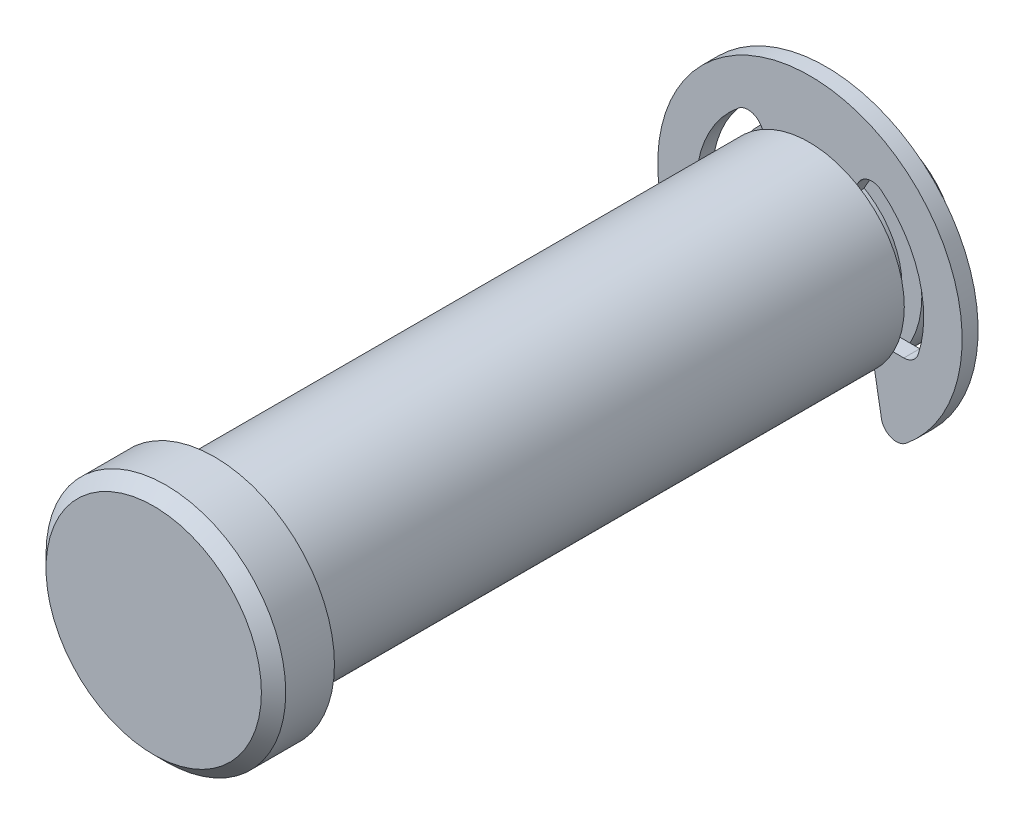
ISO-10303-21;
HEADER;
FILE_DESCRIPTION(('STEP AP214'),'2;1');
FILE_NAME('part.step','',(''),(''),'','','');
FILE_SCHEMA(('AUTOMOTIVE_DESIGN { 1 0 10303 214 1 1 1 1 }'));
ENDSEC;
DATA;
#1=APPLICATION_CONTEXT('core data for automotive mechanical design processes');
#2=APPLICATION_PROTOCOL_DEFINITION('international standard','automotive_design',2000,#1);
#3=PRODUCT_CONTEXT('',#1,'mechanical');
#4=PRODUCT('Part','Part','',(#3));
#5=PRODUCT_RELATED_PRODUCT_CATEGORY('part','',(#4));
#6=PRODUCT_DEFINITION_FORMATION('','',#4);
#7=PRODUCT_DEFINITION_CONTEXT('part definition',#1,'design');
#8=PRODUCT_DEFINITION('design','',#6,#7);
#9=PRODUCT_DEFINITION_SHAPE('','',#8);
#10=(LENGTH_UNIT() NAMED_UNIT(*) SI_UNIT(.MILLI.,.METRE.));
#11=(NAMED_UNIT(*) PLANE_ANGLE_UNIT() SI_UNIT($,.RADIAN.));
#12=(NAMED_UNIT(*) SI_UNIT($,.STERADIAN.) SOLID_ANGLE_UNIT());
#13=UNCERTAINTY_MEASURE_WITH_UNIT(LENGTH_MEASURE(1.E-05),#10,'distance_accuracy_value','');
#14=(GEOMETRIC_REPRESENTATION_CONTEXT(3) GLOBAL_UNCERTAINTY_ASSIGNED_CONTEXT((#13)) GLOBAL_UNIT_ASSIGNED_CONTEXT((#10,
#11,#12)) REPRESENTATION_CONTEXT('',''));
#15=CARTESIAN_POINT('',(0.,0.,0.));
#16=DIRECTION('',(0.,0.,1.));
#17=DIRECTION('',(1.,0.,0.));
#18=AXIS2_PLACEMENT_3D('',#15,#16,#17);
#19=CARTESIAN_POINT('',(0.,0.,-17.5133));
#20=DIRECTION('',(0.,0.,1.));
#21=DIRECTION('',(1.,0.,0.));
#22=AXIS2_PLACEMENT_3D('',#19,#20,#21);
#23=PLANE('',#22);
#24=DIRECTION('',(-0.173648177666931,0.984807753012208,0.));
#25=VECTOR('',#24,1.);
#26=CARTESIAN_POINT('',(3.38601453993856,0.59704572046233,-17.5133));
#27=LINE('',#26,#25);
#28=CARTESIAN_POINT('',(4.77272760963657,-7.26739490074226,-17.5133));
#29=VERTEX_POINT('',#28);
#30=CARTESIAN_POINT('',(4.02336,-3.01752,-17.5133));
#31=VERTEX_POINT('',#30);
#32=EDGE_CURVE('E205',#29,#31,#27,.T.);
#33=ORIENTED_EDGE('',*,*,#32,.F.);
#34=CARTESIAN_POINT('',(5.77329228669698,-7.09096835223266,-17.5133));
#35=DIRECTION('',(0.,0.,1.));
#36=DIRECTION('',(1.,0.,0.));
#37=AXIS2_PLACEMENT_3D('',#34,#35,#36);
#38=CIRCLE('',#37,1.016);
#39=CARTESIAN_POINT('',(6.41476920744109,-7.87885372470296,-17.5133));
#40=VERTEX_POINT('',#39);
#41=EDGE_CURVE('E259',#29,#40,#38,.T.);
#42=ORIENTED_EDGE('',*,*,#41,.T.);
#43=CARTESIAN_POINT('',(0.,0.,-17.5133));
#44=DIRECTION('',(0.,0.,1.));
#45=DIRECTION('',(1.,0.,0.));
#46=AXIS2_PLACEMENT_3D('',#43,#44,#45);
#47=CIRCLE('',#46,10.16);
#48=CARTESIAN_POINT('',(-6.41476920744109,-7.87885372470296,-17.5133));
#49=VERTEX_POINT('',#48);
#50=EDGE_CURVE('E185',#40,#49,#47,.T.);
#51=ORIENTED_EDGE('',*,*,#50,.T.);
#52=CARTESIAN_POINT('',(-5.77329228669698,-7.09096835223266,-17.5133));
#53=DIRECTION('',(0.,0.,1.));
#54=DIRECTION('',(1.,0.,0.));
#55=AXIS2_PLACEMENT_3D('',#52,#53,#54);
#56=CIRCLE('',#55,1.016);
#57=CARTESIAN_POINT('',(-4.77272760963657,-7.26739490074226,-17.5133));
#58=VERTEX_POINT('',#57);
#59=EDGE_CURVE('E257',#49,#58,#56,.T.);
#60=ORIENTED_EDGE('',*,*,#59,.T.);
#61=DIRECTION('',(-0.173648177666931,-0.984807753012208,0.));
#62=VECTOR('',#61,1.);
#63=CARTESIAN_POINT('',(-3.38601453993856,0.59704572046233,-17.5133));
#64=LINE('',#63,#62);
#65=CARTESIAN_POINT('',(-4.02336,-3.01752,-17.5133));
#66=VERTEX_POINT('',#65);
#67=EDGE_CURVE('E201',#66,#58,#64,.T.);
#68=ORIENTED_EDGE('',*,*,#67,.F.);
#69=DIRECTION('',(1.,0.,0.));
#70=VECTOR('',#69,1.);
#71=CARTESIAN_POINT('',(0.,-3.01752,-17.5133));
#72=LINE('',#71,#70);
#73=CARTESIAN_POINT('',(-6.26672926251007,-3.01752,-17.5133));
#74=VERTEX_POINT('',#73);
#75=EDGE_CURVE('E192',#74,#66,#72,.T.);
#76=ORIENTED_EDGE('',*,*,#75,.F.);
#77=CARTESIAN_POINT('',(-6.26672926251007,-2.00152,-17.5133));
#78=DIRECTION('',(0.,0.,1.));
#79=DIRECTION('',(1.,0.,0.));
#80=AXIS2_PLACEMENT_3D('',#77,#78,#79);
#81=CIRCLE('',#80,1.016);
#82=CARTESIAN_POINT('',(-7.23456389764676,-2.31063505791506,-17.5133));
#83=VERTEX_POINT('',#82);
#84=EDGE_CURVE('E57',#74,#83,#81,.F.);
#85=ORIENTED_EDGE('',*,*,#84,.T.);
#86=CARTESIAN_POINT('',(0.,0.,-17.5133));
#87=DIRECTION('',(0.,0.,1.));
#88=DIRECTION('',(1.,0.,0.));
#89=AXIS2_PLACEMENT_3D('',#86,#87,#88);
#90=CIRCLE('',#89,7.5946);
#91=CARTESIAN_POINT('',(-4.76751143844716,5.91174964323384,-17.5133));
#92=VERTEX_POINT('',#91);
#93=EDGE_CURVE('E217',#92,#83,#90,.T.);
#94=ORIENTED_EDGE('',*,*,#93,.F.);
#95=CARTESIAN_POINT('',(-4.12971726607965,5.12088012574437,-17.5133));
#96=DIRECTION('',(0.,0.,1.));
#97=DIRECTION('',(1.,0.,0.));
#98=AXIS2_PLACEMENT_3D('',#95,#96,#97);
#99=CIRCLE('',#98,1.016);
#100=CARTESIAN_POINT('',(-3.24983545583466,5.62888012574437,-17.5133));
#101=VERTEX_POINT('',#100);
#102=EDGE_CURVE('E189',#92,#101,#99,.F.);
#103=ORIENTED_EDGE('',*,*,#102,.T.);
#104=DIRECTION('',(-0.500000000000001,0.866025403784438,0.));
#105=VECTOR('',#104,1.);
#106=CARTESIAN_POINT('',(0.,0.,-17.5133));
#107=LINE('',#106,#105);
#108=CARTESIAN_POINT('',(-2.51460000000001,4.35541496071269,-17.5133));
#109=VERTEX_POINT('',#108);
#110=EDGE_CURVE('E181',#109,#101,#107,.T.);
#111=ORIENTED_EDGE('',*,*,#110,.F.);
#112=DIRECTION('',(1.,0.,0.));
#113=VECTOR('',#112,1.);
#114=CARTESIAN_POINT('',(-2.51460000000001,4.35541496071269,-17.5133));
#115=LINE('',#114,#113);
#116=CARTESIAN_POINT('',(2.51460000000001,4.35541496071269,-17.5133));
#117=VERTEX_POINT('',#116);
#118=EDGE_CURVE('E165',#109,#117,#115,.T.);
#119=ORIENTED_EDGE('',*,*,#118,.T.);
#120=DIRECTION('',(-0.500000000000001,-0.866025403784438,0.));
#121=VECTOR('',#120,1.);
#122=CARTESIAN_POINT('',(0.,0.,-17.5133));
#123=LINE('',#122,#121);
#124=CARTESIAN_POINT('',(3.24983545583466,5.62888012574437,-17.5133));
#125=VERTEX_POINT('',#124);
#126=EDGE_CURVE('E215',#125,#117,#123,.T.);
#127=ORIENTED_EDGE('',*,*,#126,.F.);
#128=CARTESIAN_POINT('',(4.12971726607965,5.12088012574437,-17.5133));
#129=DIRECTION('',(0.,0.,1.));
#130=DIRECTION('',(1.,0.,0.));
#131=AXIS2_PLACEMENT_3D('',#128,#129,#130);
#132=CIRCLE('',#131,1.016);
#133=CARTESIAN_POINT('',(4.76751143844716,5.91174964323384,-17.5133));
#134=VERTEX_POINT('',#133);
#135=EDGE_CURVE('E274',#125,#134,#132,.F.);
#136=ORIENTED_EDGE('',*,*,#135,.T.);
#137=CARTESIAN_POINT('',(0.,0.,-17.5133));
#138=DIRECTION('',(0.,0.,1.));
#139=DIRECTION('',(1.,0.,0.));
#140=AXIS2_PLACEMENT_3D('',#137,#138,#139);
#141=CIRCLE('',#140,7.5946);
#142=CARTESIAN_POINT('',(7.23456389764676,-2.31063505791506,-17.5133));
#143=VERTEX_POINT('',#142);
#144=EDGE_CURVE('E220',#143,#134,#141,.T.);
#145=ORIENTED_EDGE('',*,*,#144,.F.);
#146=CARTESIAN_POINT('',(6.26672926251007,-2.00152,-17.5133));
#147=DIRECTION('',(0.,0.,1.));
#148=DIRECTION('',(1.,0.,0.));
#149=AXIS2_PLACEMENT_3D('',#146,#147,#148);
#150=CIRCLE('',#149,1.016);
#151=CARTESIAN_POINT('',(6.26672926251007,-3.01752,-17.5133));
#152=VERTEX_POINT('',#151);
#153=EDGE_CURVE('E270',#143,#152,#150,.F.);
#154=ORIENTED_EDGE('',*,*,#153,.T.);
#155=DIRECTION('',(1.,0.,0.));
#156=VECTOR('',#155,1.);
#157=CARTESIAN_POINT('',(0.,-3.01752,-17.5133));
#158=LINE('',#157,#156);
#159=EDGE_CURVE('E210',#31,#152,#158,.T.);
#160=ORIENTED_EDGE('',*,*,#159,.F.);
#161=EDGE_LOOP('',(#33,#42,#51,#60,#68,#76,#85,#94,#103,#111,#119,#127,#136,#145,#154,#160));
#162=FACE_BOUND('',#161,.T.);
#163=ADVANCED_FACE('F49',(#162),#23,.T.);
#164=CARTESIAN_POINT('',(0.,0.,-18.5801));
#165=DIRECTION('',(0.,0.,1.));
#166=DIRECTION('',(1.,0.,0.));
#167=AXIS2_PLACEMENT_3D('',#164,#165,#166);
#168=PLANE('',#167);
#169=CARTESIAN_POINT('',(0.,0.,-18.5801));
#170=DIRECTION('',(0.,0.,1.));
#171=DIRECTION('',(1.,0.,0.));
#172=AXIS2_PLACEMENT_3D('',#169,#170,#171);
#173=CIRCLE('',#172,10.16);
#174=CARTESIAN_POINT('',(6.41476920744109,-7.87885372470296,-18.5801));
#175=VERTEX_POINT('',#174);
#176=CARTESIAN_POINT('',(-6.41476920744109,-7.87885372470296,-18.5801));
#177=VERTEX_POINT('',#176);
#178=EDGE_CURVE('E223',#175,#177,#173,.T.);
#179=ORIENTED_EDGE('',*,*,#178,.F.);
#180=CARTESIAN_POINT('',(5.77329228669698,-7.09096835223266,-18.5801));
#181=DIRECTION('',(0.,0.,1.));
#182=DIRECTION('',(1.,0.,0.));
#183=AXIS2_PLACEMENT_3D('',#180,#181,#182);
#184=CIRCLE('',#183,1.016);
#185=CARTESIAN_POINT('',(4.77272760963657,-7.26739490074226,-18.5801));
#186=VERTEX_POINT('',#185);
#187=EDGE_CURVE('E267',#175,#186,#184,.F.);
#188=ORIENTED_EDGE('',*,*,#187,.T.);
#189=DIRECTION('',(-0.173648177666931,0.984807753012208,0.));
#190=VECTOR('',#189,1.);
#191=CARTESIAN_POINT('',(3.38601453993856,0.59704572046233,-18.5801));
#192=LINE('',#191,#190);
#193=CARTESIAN_POINT('',(4.02336,-3.01752,-18.5801));
#194=VERTEX_POINT('',#193);
#195=EDGE_CURVE('E203',#186,#194,#192,.T.);
#196=ORIENTED_EDGE('',*,*,#195,.T.);
#197=DIRECTION('',(1.,0.,0.));
#198=VECTOR('',#197,1.);
#199=CARTESIAN_POINT('',(0.,-3.01752,-18.5801));
#200=LINE('',#199,#198);
#201=CARTESIAN_POINT('',(6.26672926251007,-3.01752,-18.5801));
#202=VERTEX_POINT('',#201);
#203=EDGE_CURVE('E207',#194,#202,#200,.T.);
#204=ORIENTED_EDGE('',*,*,#203,.T.);
#205=CARTESIAN_POINT('',(6.26672926251007,-2.00152,-18.5801));
#206=DIRECTION('',(0.,0.,1.));
#207=DIRECTION('',(1.,0.,0.));
#208=AXIS2_PLACEMENT_3D('',#205,#206,#207);
#209=CIRCLE('',#208,1.016);
#210=CARTESIAN_POINT('',(7.23456389764676,-2.31063505791506,-18.5801));
#211=VERTEX_POINT('',#210);
#212=EDGE_CURVE('E272',#202,#211,#209,.T.);
#213=ORIENTED_EDGE('',*,*,#212,.T.);
#214=CARTESIAN_POINT('',(0.,0.,-18.5801));
#215=DIRECTION('',(0.,0.,1.));
#216=DIRECTION('',(1.,0.,0.));
#217=AXIS2_PLACEMENT_3D('',#214,#215,#216);
#218=CIRCLE('',#217,7.5946);
#219=CARTESIAN_POINT('',(4.76751143844716,5.91174964323384,-18.5801));
#220=VERTEX_POINT('',#219);
#221=EDGE_CURVE('E231',#211,#220,#218,.T.);
#222=ORIENTED_EDGE('',*,*,#221,.T.);
#223=CARTESIAN_POINT('',(4.12971726607965,5.12088012574437,-18.5801));
#224=DIRECTION('',(0.,0.,1.));
#225=DIRECTION('',(1.,0.,0.));
#226=AXIS2_PLACEMENT_3D('',#223,#224,#225);
#227=CIRCLE('',#226,1.016);
#228=CARTESIAN_POINT('',(3.24983545583466,5.62888012574437,-18.5801));
#229=VERTEX_POINT('',#228);
#230=EDGE_CURVE('E276',#220,#229,#227,.T.);
#231=ORIENTED_EDGE('',*,*,#230,.T.);
#232=DIRECTION('',(-0.500000000000001,-0.866025403784438,0.));
#233=VECTOR('',#232,1.);
#234=CARTESIAN_POINT('',(0.,0.,-18.5801));
#235=LINE('',#234,#233);
#236=CARTESIAN_POINT('',(2.51460000000001,4.35541496071269,-18.5801));
#237=VERTEX_POINT('',#236);
#238=EDGE_CURVE('E213',#229,#237,#235,.T.);
#239=ORIENTED_EDGE('',*,*,#238,.T.);
#240=DIRECTION('',(-1.,0.,0.));
#241=VECTOR('',#240,1.);
#242=CARTESIAN_POINT('',(-2.51460000000001,4.35541496071269,-18.5801));
#243=LINE('',#242,#241);
#244=CARTESIAN_POINT('',(-2.51460000000001,4.35541496071269,-18.5801));
#245=VERTEX_POINT('',#244);
#246=EDGE_CURVE('E176',#237,#245,#243,.T.);
#247=ORIENTED_EDGE('',*,*,#246,.T.);
#248=DIRECTION('',(-0.500000000000001,0.866025403784438,0.));
#249=VECTOR('',#248,1.);
#250=CARTESIAN_POINT('',(0.,0.,-18.5801));
#251=LINE('',#250,#249);
#252=CARTESIAN_POINT('',(-3.24983545583466,5.62888012574437,-18.5801));
#253=VERTEX_POINT('',#252);
#254=EDGE_CURVE('E184',#245,#253,#251,.T.);
#255=ORIENTED_EDGE('',*,*,#254,.T.);
#256=CARTESIAN_POINT('',(-4.12971726607965,5.12088012574437,-18.5801));
#257=DIRECTION('',(0.,0.,1.));
#258=DIRECTION('',(1.,0.,0.));
#259=AXIS2_PLACEMENT_3D('',#256,#257,#258);
#260=CIRCLE('',#259,1.016);
#261=CARTESIAN_POINT('',(-4.76751143844716,5.91174964323384,-18.5801));
#262=VERTEX_POINT('',#261);
#263=EDGE_CURVE('E279',#253,#262,#260,.T.);
#264=ORIENTED_EDGE('',*,*,#263,.T.);
#265=CARTESIAN_POINT('',(0.,0.,-18.5801));
#266=DIRECTION('',(0.,0.,1.));
#267=DIRECTION('',(1.,0.,0.));
#268=AXIS2_PLACEMENT_3D('',#265,#266,#267);
#269=CIRCLE('',#268,7.5946);
#270=CARTESIAN_POINT('',(-7.23456389764676,-2.31063505791506,-18.5801));
#271=VERTEX_POINT('',#270);
#272=EDGE_CURVE('E228',#262,#271,#269,.T.);
#273=ORIENTED_EDGE('',*,*,#272,.T.);
#274=CARTESIAN_POINT('',(-6.26672926251007,-2.00152,-18.5801));
#275=DIRECTION('',(0.,0.,1.));
#276=DIRECTION('',(1.,0.,0.));
#277=AXIS2_PLACEMENT_3D('',#274,#275,#276);
#278=CIRCLE('',#277,1.016);
#279=CARTESIAN_POINT('',(-6.26672926251007,-3.01752,-18.5801));
#280=VERTEX_POINT('',#279);
#281=EDGE_CURVE('E12',#271,#280,#278,.T.);
#282=ORIENTED_EDGE('',*,*,#281,.T.);
#283=DIRECTION('',(1.,0.,0.));
#284=VECTOR('',#283,1.);
#285=CARTESIAN_POINT('',(0.,-3.01752,-18.5801));
#286=LINE('',#285,#284);
#287=CARTESIAN_POINT('',(-4.02336,-3.01752,-18.5801));
#288=VERTEX_POINT('',#287);
#289=EDGE_CURVE('E190',#280,#288,#286,.T.);
#290=ORIENTED_EDGE('',*,*,#289,.T.);
#291=DIRECTION('',(-0.173648177666931,-0.984807753012208,0.));
#292=VECTOR('',#291,1.);
#293=CARTESIAN_POINT('',(-3.38601453993856,0.59704572046233,-18.5801));
#294=LINE('',#293,#292);
#295=CARTESIAN_POINT('',(-4.77272760963657,-7.26739490074226,-18.5801));
#296=VERTEX_POINT('',#295);
#297=EDGE_CURVE('E199',#288,#296,#294,.T.);
#298=ORIENTED_EDGE('',*,*,#297,.T.);
#299=CARTESIAN_POINT('',(-5.77329228669698,-7.09096835223266,-18.5801));
#300=DIRECTION('',(0.,0.,1.));
#301=DIRECTION('',(1.,0.,0.));
#302=AXIS2_PLACEMENT_3D('',#299,#300,#301);
#303=CIRCLE('',#302,1.016);
#304=EDGE_CURVE('E71',#296,#177,#303,.F.);
#305=ORIENTED_EDGE('',*,*,#304,.T.);
#306=EDGE_LOOP('',(#179,#188,#196,#204,#213,#222,#231,#239,#247,#255,#264,#273,#282,#290,#298,#305));
#307=FACE_BOUND('',#306,.T.);
#308=ADVANCED_FACE('F292',(#307),#168,.F.);
#309=CARTESIAN_POINT('',(0.,0.,-17.5133));
#310=DIRECTION('',(0.,0.,-1.));
#311=DIRECTION('',(-1.,0.,0.));
#312=AXIS2_PLACEMENT_3D('',#309,#310,#311);
#313=CYLINDRICAL_SURFACE('',#312,10.16);
#314=ORIENTED_EDGE('',*,*,#50,.F.);
#315=DIRECTION('',(0.,0.,-1.));
#316=VECTOR('',#315,1.);
#317=CARTESIAN_POINT('',(6.41476920744109,-7.87885372470296,-17.5133));
#318=LINE('',#317,#316);
#319=EDGE_CURVE('E264',#40,#175,#318,.T.);
#320=ORIENTED_EDGE('',*,*,#319,.T.);
#321=ORIENTED_EDGE('',*,*,#178,.T.);
#322=DIRECTION('',(0.,0.,-1.));
#323=VECTOR('',#322,1.);
#324=CARTESIAN_POINT('',(-6.41476920744109,-7.87885372470296,-17.5133));
#325=LINE('',#324,#323);
#326=EDGE_CURVE('E261',#177,#49,#325,.F.);
#327=ORIENTED_EDGE('',*,*,#326,.T.);
#328=EDGE_LOOP('',(#314,#320,#321,#327));
#329=FACE_BOUND('',#328,.T.);
#330=ADVANCED_FACE('F332',(#329),#313,.T.);
#331=CARTESIAN_POINT('',(-4.02336,-3.01752,-22.225));
#332=DIRECTION('',(-0.984807753012208,0.173648177666931,0.));
#333=DIRECTION('',(-0.173648177666931,-0.984807753012208,0.));
#334=AXIS2_PLACEMENT_3D('',#331,#332,#333);
#335=PLANE('',#334);
#336=ORIENTED_EDGE('',*,*,#67,.T.);
#337=DIRECTION('',(0.,0.,-1.));
#338=VECTOR('',#337,1.);
#339=CARTESIAN_POINT('',(-4.77272760963657,-7.26739490074226,-22.225));
#340=LINE('',#339,#338);
#341=EDGE_CURVE('E64',#58,#296,#340,.T.);
#342=ORIENTED_EDGE('',*,*,#341,.T.);
#343=ORIENTED_EDGE('',*,*,#297,.F.);
#344=DIRECTION('',(0.,0.,1.));
#345=VECTOR('',#344,1.);
#346=CARTESIAN_POINT('',(-4.02336,-3.01752,-22.225));
#347=LINE('',#346,#345);
#348=EDGE_CURVE('E297',#288,#66,#347,.T.);
#349=ORIENTED_EDGE('',*,*,#348,.T.);
#350=EDGE_LOOP('',(#336,#342,#343,#349));
#351=FACE_BOUND('',#350,.T.);
#352=ADVANCED_FACE('F337',(#351),#335,.F.);
#353=CARTESIAN_POINT('',(-3.79730000000001,6.57711653158129,-22.225));
#354=DIRECTION('',(0.866025403784438,0.500000000000001,0.));
#355=DIRECTION('',(-0.500000000000001,0.866025403784438,0.));
#356=AXIS2_PLACEMENT_3D('',#353,#354,#355);
#357=PLANE('',#356);
#358=ORIENTED_EDGE('',*,*,#110,.T.);
#359=DIRECTION('',(0.,0.,-1.));
#360=VECTOR('',#359,1.);
#361=CARTESIAN_POINT('',(-3.24983545583466,5.62888012574437,-18.5801));
#362=LINE('',#361,#360);
#363=EDGE_CURVE('E249',#101,#253,#362,.T.);
#364=ORIENTED_EDGE('',*,*,#363,.T.);
#365=ORIENTED_EDGE('',*,*,#254,.F.);
#366=DIRECTION('',(0.,0.,-1.));
#367=VECTOR('',#366,1.);
#368=CARTESIAN_POINT('',(-2.51460000000001,4.35541496071269,-17.5133));
#369=LINE('',#368,#367);
#370=EDGE_CURVE('E169',#245,#109,#369,.F.);
#371=ORIENTED_EDGE('',*,*,#370,.T.);
#372=EDGE_LOOP('',(#358,#364,#365,#371));
#373=FACE_BOUND('',#372,.T.);
#374=ADVANCED_FACE('F180',(#373),#357,.F.);
#375=CARTESIAN_POINT('',(0.,0.,-22.225));
#376=DIRECTION('',(0.,0.,1.));
#377=DIRECTION('',(1.,0.,0.));
#378=AXIS2_PLACEMENT_3D('',#375,#376,#377);
#379=CYLINDRICAL_SURFACE('',#378,7.5946);
#380=ORIENTED_EDGE('',*,*,#272,.F.);
#381=DIRECTION('',(0.,0.,1.));
#382=VECTOR('',#381,1.);
#383=CARTESIAN_POINT('',(-4.76751143844716,5.91174964323385,-22.225));
#384=LINE('',#383,#382);
#385=EDGE_CURVE('E246',#262,#92,#384,.T.);
#386=ORIENTED_EDGE('',*,*,#385,.T.);
#387=ORIENTED_EDGE('',*,*,#93,.T.);
#388=DIRECTION('',(0.,0.,1.));
#389=VECTOR('',#388,1.);
#390=CARTESIAN_POINT('',(-7.23456389764676,-2.31063505791506,-22.225));
#391=LINE('',#390,#389);
#392=EDGE_CURVE('E244',#83,#271,#391,.F.);
#393=ORIENTED_EDGE('',*,*,#392,.T.);
#394=EDGE_LOOP('',(#380,#386,#387,#393));
#395=FACE_BOUND('',#394,.T.);
#396=ADVANCED_FACE('F287',(#395),#379,.F.);
#397=CARTESIAN_POINT('',(-6.96939898481928,-3.01752,-22.225));
#398=DIRECTION('',(0.,-1.,0.));
#399=DIRECTION('',(0.,0.,-1.));
#400=AXIS2_PLACEMENT_3D('',#397,#398,#399);
#401=PLANE('',#400);
#402=ORIENTED_EDGE('',*,*,#289,.F.);
#403=DIRECTION('',(0.,0.,-1.));
#404=VECTOR('',#403,1.);
#405=CARTESIAN_POINT('',(-6.26672926251007,-3.01752,-17.5133));
#406=LINE('',#405,#404);
#407=EDGE_CURVE('E251',#280,#74,#406,.F.);
#408=ORIENTED_EDGE('',*,*,#407,.T.);
#409=ORIENTED_EDGE('',*,*,#75,.T.);
#410=ORIENTED_EDGE('',*,*,#348,.F.);
#411=EDGE_LOOP('',(#402,#408,#409,#410));
#412=FACE_BOUND('',#411,.T.);
#413=ADVANCED_FACE('F295',(#412),#401,.F.);
#414=CARTESIAN_POINT('',(0.,0.,-22.225));
#415=DIRECTION('',(0.,0.,1.));
#416=DIRECTION('',(1.,0.,0.));
#417=AXIS2_PLACEMENT_3D('',#414,#415,#416);
#418=CYLINDRICAL_SURFACE('',#417,7.5946);
#419=ORIENTED_EDGE('',*,*,#221,.F.);
#420=DIRECTION('',(0.,0.,1.));
#421=VECTOR('',#420,1.);
#422=CARTESIAN_POINT('',(7.23456389764676,-2.31063505791506,-22.225));
#423=LINE('',#422,#421);
#424=EDGE_CURVE('E236',#211,#143,#423,.T.);
#425=ORIENTED_EDGE('',*,*,#424,.T.);
#426=ORIENTED_EDGE('',*,*,#144,.T.);
#427=DIRECTION('',(0.,0.,1.));
#428=VECTOR('',#427,1.);
#429=CARTESIAN_POINT('',(4.76751143844716,5.91174964323385,-22.225));
#430=LINE('',#429,#428);
#431=EDGE_CURVE('E234',#134,#220,#430,.F.);
#432=ORIENTED_EDGE('',*,*,#431,.T.);
#433=EDGE_LOOP('',(#419,#425,#426,#432));
#434=FACE_BOUND('',#433,.T.);
#435=ADVANCED_FACE('F311',(#434),#418,.F.);
#436=CARTESIAN_POINT('',(4.02336,-3.01752,-22.225));
#437=DIRECTION('',(0.,-1.,0.));
#438=DIRECTION('',(0.,0.,-1.));
#439=AXIS2_PLACEMENT_3D('',#436,#437,#438);
#440=PLANE('',#439);
#441=ORIENTED_EDGE('',*,*,#159,.T.);
#442=DIRECTION('',(0.,0.,-1.));
#443=VECTOR('',#442,1.);
#444=CARTESIAN_POINT('',(6.26672926251007,-3.01752,-18.5801));
#445=LINE('',#444,#443);
#446=EDGE_CURVE('E239',#152,#202,#445,.T.);
#447=ORIENTED_EDGE('',*,*,#446,.T.);
#448=ORIENTED_EDGE('',*,*,#203,.F.);
#449=DIRECTION('',(0.,0.,1.));
#450=VECTOR('',#449,1.);
#451=CARTESIAN_POINT('',(4.02336,-3.01752,-22.225));
#452=LINE('',#451,#450);
#453=EDGE_CURVE('E194',#194,#31,#452,.T.);
#454=ORIENTED_EDGE('',*,*,#453,.T.);
#455=EDGE_LOOP('',(#441,#447,#448,#454));
#456=FACE_BOUND('',#455,.T.);
#457=ADVANCED_FACE('F321',(#456),#440,.F.);
#458=CARTESIAN_POINT('',(4.02336,-3.01752,-22.225));
#459=DIRECTION('',(0.984807753012208,0.173648177666931,0.));
#460=DIRECTION('',(-0.173648177666931,0.984807753012208,0.));
#461=AXIS2_PLACEMENT_3D('',#458,#459,#460);
#462=PLANE('',#461);
#463=ORIENTED_EDGE('',*,*,#195,.F.);
#464=DIRECTION('',(0.,0.,-1.));
#465=VECTOR('',#464,1.);
#466=CARTESIAN_POINT('',(4.77272760963657,-7.26739490074226,-22.225));
#467=LINE('',#466,#465);
#468=EDGE_CURVE('E254',#186,#29,#467,.F.);
#469=ORIENTED_EDGE('',*,*,#468,.T.);
#470=ORIENTED_EDGE('',*,*,#32,.T.);
#471=ORIENTED_EDGE('',*,*,#453,.F.);
#472=EDGE_LOOP('',(#463,#469,#470,#471));
#473=FACE_BOUND('',#472,.T.);
#474=ADVANCED_FACE('F326',(#473),#462,.F.);
#475=CARTESIAN_POINT('',(0.,0.,-22.225));
#476=DIRECTION('',(-0.866025403784438,0.500000000000001,0.));
#477=DIRECTION('',(-0.500000000000001,-0.866025403784438,0.));
#478=AXIS2_PLACEMENT_3D('',#475,#476,#477);
#479=PLANE('',#478);
#480=ORIENTED_EDGE('',*,*,#238,.F.);
#481=DIRECTION('',(0.,0.,-1.));
#482=VECTOR('',#481,1.);
#483=CARTESIAN_POINT('',(3.24983545583466,5.62888012574437,-17.5133));
#484=LINE('',#483,#482);
#485=EDGE_CURVE('E241',#229,#125,#484,.F.);
#486=ORIENTED_EDGE('',*,*,#485,.T.);
#487=ORIENTED_EDGE('',*,*,#126,.T.);
#488=DIRECTION('',(0.,0.,-1.));
#489=VECTOR('',#488,1.);
#490=CARTESIAN_POINT('',(2.51460000000001,4.35541496071269,-17.5133));
#491=LINE('',#490,#489);
#492=EDGE_CURVE('E172',#117,#237,#491,.T.);
#493=ORIENTED_EDGE('',*,*,#492,.T.);
#494=EDGE_LOOP('',(#480,#486,#487,#493));
#495=FACE_BOUND('',#494,.T.);
#496=ADVANCED_FACE('F304',(#495),#479,.F.);
#497=CARTESIAN_POINT('',(-2.51460000000001,4.35541496071269,-23.654234302437));
#498=DIRECTION('',(0.,-1.,0.));
#499=DIRECTION('',(0.,0.,-1.));
#500=AXIS2_PLACEMENT_3D('',#497,#498,#499);
#501=PLANE('',#500);
#502=ORIENTED_EDGE('',*,*,#246,.F.);
#503=ORIENTED_EDGE('',*,*,#492,.F.);
#504=ORIENTED_EDGE('',*,*,#118,.F.);
#505=ORIENTED_EDGE('',*,*,#370,.F.);
#506=EDGE_LOOP('',(#502,#503,#504,#505));
#507=FACE_BOUND('',#506,.T.);
#508=ADVANCED_FACE('F168',(#507),#501,.T.);
#509=CARTESIAN_POINT('',(6.26672926251007,-2.00152,-22.225));
#510=DIRECTION('',(0.,0.,1.));
#511=DIRECTION('',(1.,0.,0.));
#512=AXIS2_PLACEMENT_3D('',#509,#510,#511);
#513=CYLINDRICAL_SURFACE('',#512,1.016);
#514=ORIENTED_EDGE('',*,*,#212,.F.);
#515=ORIENTED_EDGE('',*,*,#446,.F.);
#516=ORIENTED_EDGE('',*,*,#153,.F.);
#517=ORIENTED_EDGE('',*,*,#424,.F.);
#518=EDGE_LOOP('',(#514,#515,#516,#517));
#519=FACE_BOUND('',#518,.T.);
#520=ADVANCED_FACE('F317',(#519),#513,.F.);
#521=CARTESIAN_POINT('',(4.12971726607965,5.12088012574437,-22.225));
#522=DIRECTION('',(0.,0.,1.));
#523=DIRECTION('',(1.,0.,0.));
#524=AXIS2_PLACEMENT_3D('',#521,#522,#523);
#525=CYLINDRICAL_SURFACE('',#524,1.016);
#526=ORIENTED_EDGE('',*,*,#230,.F.);
#527=ORIENTED_EDGE('',*,*,#431,.F.);
#528=ORIENTED_EDGE('',*,*,#135,.F.);
#529=ORIENTED_EDGE('',*,*,#485,.F.);
#530=EDGE_LOOP('',(#526,#527,#528,#529));
#531=FACE_BOUND('',#530,.T.);
#532=ADVANCED_FACE('F314',(#531),#525,.F.);
#533=CARTESIAN_POINT('',(-4.12971726607965,5.12088012574437,-22.225));
#534=DIRECTION('',(0.,0.,1.));
#535=DIRECTION('',(1.,0.,0.));
#536=AXIS2_PLACEMENT_3D('',#533,#534,#535);
#537=CYLINDRICAL_SURFACE('',#536,1.016);
#538=ORIENTED_EDGE('',*,*,#263,.F.);
#539=ORIENTED_EDGE('',*,*,#363,.F.);
#540=ORIENTED_EDGE('',*,*,#102,.F.);
#541=ORIENTED_EDGE('',*,*,#385,.F.);
#542=EDGE_LOOP('',(#538,#539,#540,#541));
#543=FACE_BOUND('',#542,.T.);
#544=ADVANCED_FACE('F361',(#543),#537,.F.);
#545=CARTESIAN_POINT('',(-6.26672926251007,-2.00152,-22.225));
#546=DIRECTION('',(0.,0.,1.));
#547=DIRECTION('',(1.,0.,0.));
#548=AXIS2_PLACEMENT_3D('',#545,#546,#547);
#549=CYLINDRICAL_SURFACE('',#548,1.016);
#550=ORIENTED_EDGE('',*,*,#281,.F.);
#551=ORIENTED_EDGE('',*,*,#392,.F.);
#552=ORIENTED_EDGE('',*,*,#84,.F.);
#553=ORIENTED_EDGE('',*,*,#407,.F.);
#554=EDGE_LOOP('',(#550,#551,#552,#553));
#555=FACE_BOUND('',#554,.T.);
#556=ADVANCED_FACE('F290',(#555),#549,.F.);
#557=CARTESIAN_POINT('',(5.77329228669698,-7.09096835223266,-17.5133));
#558=DIRECTION('',(0.,0.,-1.));
#559=DIRECTION('',(-1.,0.,0.));
#560=AXIS2_PLACEMENT_3D('',#557,#558,#559);
#561=CYLINDRICAL_SURFACE('',#560,1.016);
#562=ORIENTED_EDGE('',*,*,#187,.F.);
#563=ORIENTED_EDGE('',*,*,#319,.F.);
#564=ORIENTED_EDGE('',*,*,#41,.F.);
#565=ORIENTED_EDGE('',*,*,#468,.F.);
#566=EDGE_LOOP('',(#562,#563,#564,#565));
#567=FACE_BOUND('',#566,.T.);
#568=ADVANCED_FACE('F335',(#567),#561,.T.);
#569=CARTESIAN_POINT('',(-5.77329228669698,-7.09096835223266,-17.5133));
#570=DIRECTION('',(0.,0.,-1.));
#571=DIRECTION('',(-1.,0.,0.));
#572=AXIS2_PLACEMENT_3D('',#569,#570,#571);
#573=CYLINDRICAL_SURFACE('',#572,1.016);
#574=ORIENTED_EDGE('',*,*,#304,.F.);
#575=ORIENTED_EDGE('',*,*,#341,.F.);
#576=ORIENTED_EDGE('',*,*,#59,.F.);
#577=ORIENTED_EDGE('',*,*,#326,.F.);
#578=EDGE_LOOP('',(#574,#575,#576,#577));
#579=FACE_BOUND('',#578,.T.);
#580=ADVANCED_FACE('F51',(#579),#573,.T.);
#581=CLOSED_SHELL('',(#163,#308,#330,#352,#374,#396,#413,#435,#457,#474,#496,#508,#520,#532,
#544,#556,#568,#580));
#582=MANIFOLD_SOLID_BREP('B2',#581);
#583=CARTESIAN_POINT('',(0.,0.,22.225));
#584=DIRECTION('',(0.,0.,-1.));
#585=DIRECTION('',(-1.,0.,0.));
#586=AXIS2_PLACEMENT_3D('',#583,#584,#585);
#587=CYLINDRICAL_SURFACE('',#586,6.35);
#588=CARTESIAN_POINT('',(0.,0.,22.225));
#589=DIRECTION('',(0.,0.,1.));
#590=DIRECTION('',(1.,0.,0.));
#591=AXIS2_PLACEMENT_3D('',#588,#589,#590);
#592=CIRCLE('',#591,6.35);
#593=CARTESIAN_POINT('',(6.35,0.,22.225));
#594=VERTEX_POINT('',#593);
#595=EDGE_CURVE('E475',#594,#594,#592,.T.);
#596=ORIENTED_EDGE('',*,*,#595,.F.);
#597=EDGE_LOOP('',(#596));
#598=FACE_BOUND('',#597,.T.);
#599=CARTESIAN_POINT('',(0.,0.,-17.4625));
#600=DIRECTION('',(0.,0.,1.));
#601=DIRECTION('',(1.,0.,0.));
#602=AXIS2_PLACEMENT_3D('',#599,#600,#601);
#603=CIRCLE('',#602,6.35);
#604=CARTESIAN_POINT('',(6.35,0.,-17.4625));
#605=VERTEX_POINT('',#604);
#606=EDGE_CURVE('E487',#605,#605,#603,.T.);
#607=ORIENTED_EDGE('',*,*,#606,.T.);
#608=EDGE_LOOP('',(#607));
#609=FACE_BOUND('',#608,.T.);
#610=ADVANCED_FACE('F455',(#598,#609),#587,.T.);
#611=CARTESIAN_POINT('',(0.,6.35,-17.4625));
#612=DIRECTION('',(0.,0.,-1.));
#613=DIRECTION('',(-1.,0.,0.));
#614=AXIS2_PLACEMENT_3D('',#611,#612,#613);
#615=PLANE('',#614);
#616=CARTESIAN_POINT('',(0.,0.,-17.4625));
#617=DIRECTION('',(0.,0.,1.));
#618=DIRECTION('',(1.,0.,0.));
#619=AXIS2_PLACEMENT_3D('',#616,#617,#618);
#620=CIRCLE('',#619,5.0292);
#621=CARTESIAN_POINT('',(5.0292,0.,-17.4625));
#622=VERTEX_POINT('',#621);
#623=EDGE_CURVE('E478',#622,#622,#620,.T.);
#624=ORIENTED_EDGE('',*,*,#623,.T.);
#625=EDGE_LOOP('',(#624));
#626=FACE_BOUND('',#625,.T.);
#627=ORIENTED_EDGE('',*,*,#606,.F.);
#628=EDGE_LOOP('',(#627));
#629=FACE_BOUND('',#628,.T.);
#630=ADVANCED_FACE('F505',(#626,#629),#615,.T.);
#631=CARTESIAN_POINT('',(0.,0.,22.225));
#632=DIRECTION('',(0.,0.,1.));
#633=DIRECTION('',(1.,0.,0.));
#634=AXIS2_PLACEMENT_3D('',#631,#632,#633);
#635=CYLINDRICAL_SURFACE('',#634,5.0292);
#636=CARTESIAN_POINT('',(0.,0.,-18.6309));
#637=DIRECTION('',(0.,0.,1.));
#638=DIRECTION('',(1.,0.,0.));
#639=AXIS2_PLACEMENT_3D('',#636,#637,#638);
#640=CIRCLE('',#639,5.0292);
#641=CARTESIAN_POINT('',(5.0292,0.,-18.6309));
#642=VERTEX_POINT('',#641);
#643=EDGE_CURVE('E481',#642,#642,#640,.T.);
#644=ORIENTED_EDGE('',*,*,#643,.T.);
#645=EDGE_LOOP('',(#644));
#646=FACE_BOUND('',#645,.T.);
#647=ORIENTED_EDGE('',*,*,#623,.F.);
#648=EDGE_LOOP('',(#647));
#649=FACE_BOUND('',#648,.T.);
#650=ADVANCED_FACE('F510',(#646,#649),#635,.T.);
#651=CARTESIAN_POINT('',(0.,6.35,-18.6309));
#652=DIRECTION('',(0.,0.,1.));
#653=DIRECTION('',(1.,0.,0.));
#654=AXIS2_PLACEMENT_3D('',#651,#652,#653);
#655=PLANE('',#654);
#656=CARTESIAN_POINT('',(0.,0.,-18.6309));
#657=DIRECTION('',(0.,0.,1.));
#658=DIRECTION('',(1.,0.,0.));
#659=AXIS2_PLACEMENT_3D('',#656,#657,#658);
#660=CIRCLE('',#659,6.35);
#661=CARTESIAN_POINT('',(6.35,0.,-18.6309));
#662=VERTEX_POINT('',#661);
#663=EDGE_CURVE('E484',#662,#662,#660,.T.);
#664=ORIENTED_EDGE('',*,*,#663,.T.);
#665=EDGE_LOOP('',(#664));
#666=FACE_BOUND('',#665,.T.);
#667=ORIENTED_EDGE('',*,*,#643,.F.);
#668=EDGE_LOOP('',(#667));
#669=FACE_BOUND('',#668,.T.);
#670=ADVANCED_FACE('F517',(#666,#669),#655,.T.);
#671=CARTESIAN_POINT('',(0.,0.,-22.225));
#672=DIRECTION('',(0.,0.,1.));
#673=DIRECTION('',(1.,0.,0.));
#674=AXIS2_PLACEMENT_3D('',#671,#672,#673);
#675=PLANE('',#674);
#676=CARTESIAN_POINT('',(0.,0.,-22.225));
#677=DIRECTION('',(0.,0.,1.));
#678=DIRECTION('',(1.,0.,0.));
#679=AXIS2_PLACEMENT_3D('',#676,#677,#678);
#680=CIRCLE('',#679,5.07999999999999);
#681=CARTESIAN_POINT('',(5.07999999999999,0.,-22.225));
#682=VERTEX_POINT('',#681);
#683=EDGE_CURVE('E48',#682,#682,#680,.F.);
#684=ORIENTED_EDGE('',*,*,#683,.T.);
#685=EDGE_LOOP('',(#684));
#686=FACE_BOUND('',#685,.T.);
#687=ADVANCED_FACE('F522',(#686),#675,.F.);
#688=CARTESIAN_POINT('',(0.,0.,-20.955));
#689=DIRECTION('',(0.,0.,1.));
#690=DIRECTION('',(1.,0.,0.));
#691=AXIS2_PLACEMENT_3D('',#688,#689,#690);
#692=CIRCLE('',#691,6.35);
#693=CARTESIAN_POINT('',(6.35,0.,-20.955));
#694=VERTEX_POINT('',#693);
#695=EDGE_CURVE('E462',#694,#694,#692,.T.);
#696=ORIENTED_EDGE('',*,*,#695,.T.);
#697=EDGE_LOOP('',(#696));
#698=FACE_BOUND('',#697,.T.);
#699=ORIENTED_EDGE('',*,*,#663,.F.);
#700=EDGE_LOOP('',(#699));
#701=FACE_BOUND('',#700,.T.);
#702=ADVANCED_FACE('F499',(#698,#701),#587,.T.);
#703=CARTESIAN_POINT('',(0.,0.,22.225));
#704=DIRECTION('',(0.,0.,1.));
#705=DIRECTION('',(1.,0.,0.));
#706=AXIS2_PLACEMENT_3D('',#703,#704,#705);
#707=PLANE('',#706);
#708=CARTESIAN_POINT('',(0.,0.,22.225));
#709=DIRECTION('',(0.,0.,1.));
#710=DIRECTION('',(1.,0.,0.));
#711=AXIS2_PLACEMENT_3D('',#708,#709,#710);
#712=CIRCLE('',#711,8.001);
#713=CARTESIAN_POINT('',(8.001,0.,22.225));
#714=VERTEX_POINT('',#713);
#715=EDGE_CURVE('E490',#714,#714,#712,.T.);
#716=ORIENTED_EDGE('',*,*,#715,.F.);
#717=EDGE_LOOP('',(#716));
#718=FACE_BOUND('',#717,.T.);
#719=ORIENTED_EDGE('',*,*,#595,.T.);
#720=EDGE_LOOP('',(#719));
#721=FACE_BOUND('',#720,.T.);
#722=ADVANCED_FACE('F496',(#718,#721),#707,.F.);
#723=CARTESIAN_POINT('',(0.,0.,26.289));
#724=DIRECTION('',(0.,0.,-1.));
#725=DIRECTION('',(-1.,0.,0.));
#726=AXIS2_PLACEMENT_3D('',#723,#724,#725);
#727=CYLINDRICAL_SURFACE('',#726,8.001);
#728=CARTESIAN_POINT('',(0.,0.,25.4762));
#729=DIRECTION('',(0.,0.,1.));
#730=DIRECTION('',(1.,0.,0.));
#731=AXIS2_PLACEMENT_3D('',#728,#729,#730);
#732=CIRCLE('',#731,8.001);
#733=CARTESIAN_POINT('',(8.001,0.,25.4762));
#734=VERTEX_POINT('',#733);
#735=EDGE_CURVE('E466',#734,#734,#732,.F.);
#736=ORIENTED_EDGE('',*,*,#735,.T.);
#737=EDGE_LOOP('',(#736));
#738=FACE_BOUND('',#737,.T.);
#739=ORIENTED_EDGE('',*,*,#715,.T.);
#740=EDGE_LOOP('',(#739));
#741=FACE_BOUND('',#740,.T.);
#742=ADVANCED_FACE('F494',(#738,#741),#727,.T.);
#743=CARTESIAN_POINT('',(0.,0.,26.289));
#744=DIRECTION('',(0.,0.,1.));
#745=DIRECTION('',(1.,0.,0.));
#746=AXIS2_PLACEMENT_3D('',#743,#744,#745);
#747=PLANE('',#746);
#748=CARTESIAN_POINT('',(0.,0.,26.289));
#749=DIRECTION('',(0.,0.,1.));
#750=DIRECTION('',(1.,0.,0.));
#751=AXIS2_PLACEMENT_3D('',#748,#749,#750);
#752=CIRCLE('',#751,7.1882);
#753=CARTESIAN_POINT('',(7.1882,0.,26.289));
#754=VERTEX_POINT('',#753);
#755=EDGE_CURVE('E470',#754,#754,#752,.T.);
#756=ORIENTED_EDGE('',*,*,#755,.T.);
#757=EDGE_LOOP('',(#756));
#758=FACE_BOUND('',#757,.T.);
#759=ADVANCED_FACE('F526',(#758),#747,.T.);
#760=CARTESIAN_POINT('',(0.,0.,26.289));
#761=DIRECTION('',(0.,0.,-1.));
#762=DIRECTION('',(-1.,0.,0.));
#763=AXIS2_PLACEMENT_3D('',#760,#761,#762);
#764=CONICAL_SURFACE('',#763,7.1882,0.785398163397447);
#765=ORIENTED_EDGE('',*,*,#735,.F.);
#766=EDGE_LOOP('',(#765));
#767=FACE_BOUND('',#766,.T.);
#768=ORIENTED_EDGE('',*,*,#755,.F.);
#769=EDGE_LOOP('',(#768));
#770=FACE_BOUND('',#769,.T.);
#771=ADVANCED_FACE('F524',(#767,#770),#764,.T.);
#772=CARTESIAN_POINT('',(0.,0.,-20.955));
#773=DIRECTION('',(0.,0.,1.));
#774=DIRECTION('',(1.,0.,0.));
#775=AXIS2_PLACEMENT_3D('',#772,#773,#774);
#776=CONICAL_SURFACE('',#775,6.35,0.78539816339745);
#777=ORIENTED_EDGE('',*,*,#683,.F.);
#778=EDGE_LOOP('',(#777));
#779=FACE_BOUND('',#778,.T.);
#780=ORIENTED_EDGE('',*,*,#695,.F.);
#781=EDGE_LOOP('',(#780));
#782=FACE_BOUND('',#781,.T.);
#783=ADVANCED_FACE('F457',(#779,#782),#776,.T.);
#784=CLOSED_SHELL('',(#610,#630,#650,#670,#687,#702,#722,#742,#759,#771,#783));
#785=MANIFOLD_SOLID_BREP('B6',#784);
#786=ADVANCED_BREP_SHAPE_REPRESENTATION('',(#18,#582,#785),#14);
#787=SHAPE_DEFINITION_REPRESENTATION(#9,#786);
ENDSEC;
END-ISO-10303-21;
